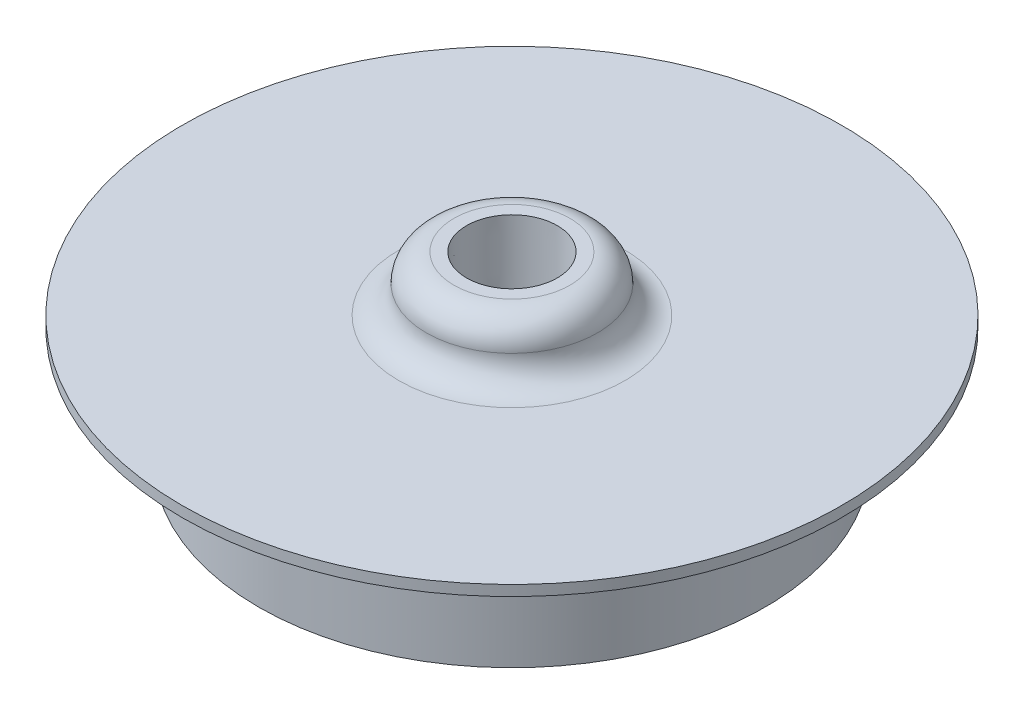
ISO-10303-21;
HEADER;
FILE_DESCRIPTION(('STEP AP214'),'2;1');
FILE_NAME('part.step','',(''),(''),'','','');
FILE_SCHEMA(('AUTOMOTIVE_DESIGN { 1 0 10303 214 1 1 1 1 }'));
ENDSEC;
DATA;
#1=APPLICATION_CONTEXT('core data for automotive mechanical design processes');
#2=APPLICATION_PROTOCOL_DEFINITION('international standard','automotive_design',2000,#1);
#3=PRODUCT_CONTEXT('',#1,'mechanical');
#4=PRODUCT('Part','Part','',(#3));
#5=PRODUCT_RELATED_PRODUCT_CATEGORY('part','',(#4));
#6=PRODUCT_DEFINITION_FORMATION('','',#4);
#7=PRODUCT_DEFINITION_CONTEXT('part definition',#1,'design');
#8=PRODUCT_DEFINITION('design','',#6,#7);
#9=PRODUCT_DEFINITION_SHAPE('','',#8);
#10=(LENGTH_UNIT() NAMED_UNIT(*) SI_UNIT(.MILLI.,.METRE.));
#11=(NAMED_UNIT(*) PLANE_ANGLE_UNIT() SI_UNIT($,.RADIAN.));
#12=(NAMED_UNIT(*) SI_UNIT($,.STERADIAN.) SOLID_ANGLE_UNIT());
#13=UNCERTAINTY_MEASURE_WITH_UNIT(LENGTH_MEASURE(1.E-05),#10,'distance_accuracy_value','');
#14=(GEOMETRIC_REPRESENTATION_CONTEXT(3) GLOBAL_UNCERTAINTY_ASSIGNED_CONTEXT((#13)) GLOBAL_UNIT_ASSIGNED_CONTEXT((#10,
#11,#12)) REPRESENTATION_CONTEXT('',''));
#15=CARTESIAN_POINT('',(0.,0.,0.));
#16=DIRECTION('',(0.,0.,1.));
#17=DIRECTION('',(1.,0.,0.));
#18=AXIS2_PLACEMENT_3D('',#15,#16,#17);
#19=CARTESIAN_POINT('',(0.,55.,0.));
#20=DIRECTION('',(0.,1.,0.));
#21=DIRECTION('',(0.,0.,1.));
#22=AXIS2_PLACEMENT_3D('',#19,#20,#21);
#23=CYLINDRICAL_SURFACE('',#22,49.784);
#24=CARTESIAN_POINT('',(0.,0.,0.));
#25=DIRECTION('',(0.,1.,0.));
#26=DIRECTION('',(0.,0.,1.));
#27=AXIS2_PLACEMENT_3D('',#24,#25,#26);
#28=CIRCLE('',#27,49.784);
#29=CARTESIAN_POINT('',(0.,0.,49.784));
#30=VERTEX_POINT('',#29);
#31=EDGE_CURVE('E10',#30,#30,#28,.T.);
#32=ORIENTED_EDGE('',*,*,#31,.T.);
#33=EDGE_LOOP('',(#32));
#34=FACE_BOUND('',#33,.T.);
#35=CARTESIAN_POINT('',(0.,1.5875,0.));
#36=DIRECTION('',(0.,1.,0.));
#37=DIRECTION('',(0.,0.,1.));
#38=AXIS2_PLACEMENT_3D('',#35,#36,#37);
#39=CIRCLE('',#38,49.784);
#40=CARTESIAN_POINT('',(0.,1.5875,49.784));
#41=VERTEX_POINT('',#40);
#42=EDGE_CURVE('E68',#41,#41,#39,.T.);
#43=ORIENTED_EDGE('',*,*,#42,.F.);
#44=EDGE_LOOP('',(#43));
#45=FACE_BOUND('',#44,.T.);
#46=ADVANCED_FACE('F31',(#34,#45),#23,.T.);
#47=CARTESIAN_POINT('',(-49.784,0.,0.));
#48=DIRECTION('',(0.,-1.,0.));
#49=DIRECTION('',(0.,0.,-1.));
#50=AXIS2_PLACEMENT_3D('',#47,#48,#49);
#51=PLANE('',#50);
#52=CARTESIAN_POINT('',(0.,0.,0.));
#53=DIRECTION('',(0.,1.,0.));
#54=DIRECTION('',(0.,0.,1.));
#55=AXIS2_PLACEMENT_3D('',#52,#53,#54);
#56=CIRCLE('',#55,39.8398999993228);
#57=CARTESIAN_POINT('',(0.,0.,39.8398999993228));
#58=VERTEX_POINT('',#57);
#59=EDGE_CURVE('E37',#58,#58,#56,.T.);
#60=ORIENTED_EDGE('',*,*,#59,.T.);
#61=EDGE_LOOP('',(#60));
#62=FACE_BOUND('',#61,.T.);
#63=ORIENTED_EDGE('',*,*,#31,.F.);
#64=EDGE_LOOP('',(#63));
#65=FACE_BOUND('',#64,.T.);
#66=ADVANCED_FACE('F99',(#62,#65),#51,.T.);
#67=CARTESIAN_POINT('',(0.,-1.5875,0.));
#68=DIRECTION('',(0.,1.,0.));
#69=DIRECTION('',(0.,0.,1.));
#70=AXIS2_PLACEMENT_3D('',#67,#68,#69);
#71=TOROIDAL_SURFACE('',#70,39.8398999993228,1.5875);
#72=CARTESIAN_POINT('',(0.,-1.5875,0.));
#73=DIRECTION('',(0.,1.,0.));
#74=DIRECTION('',(0.,0.,1.));
#75=AXIS2_PLACEMENT_3D('',#72,#73,#74);
#76=CIRCLE('',#75,38.2523999993228);
#77=CARTESIAN_POINT('',(0.,-1.5875,38.2523999993228));
#78=VERTEX_POINT('',#77);
#79=EDGE_CURVE('E41',#78,#78,#76,.T.);
#80=ORIENTED_EDGE('',*,*,#79,.T.);
#81=EDGE_LOOP('',(#80));
#82=FACE_BOUND('',#81,.T.);
#83=ORIENTED_EDGE('',*,*,#59,.F.);
#84=EDGE_LOOP('',(#83));
#85=FACE_BOUND('',#84,.T.);
#86=ADVANCED_FACE('F103',(#82,#85),#71,.F.);
#87=CARTESIAN_POINT('',(0.,55.,0.));
#88=DIRECTION('',(0.,1.,0.));
#89=DIRECTION('',(0.,0.,1.));
#90=AXIS2_PLACEMENT_3D('',#87,#88,#89);
#91=CYLINDRICAL_SURFACE('',#90,38.2523999996614);
#92=CARTESIAN_POINT('',(0.,-17.4625,0.));
#93=DIRECTION('',(0.,1.,0.));
#94=DIRECTION('',(0.,0.,1.));
#95=AXIS2_PLACEMENT_3D('',#92,#93,#94);
#96=CIRCLE('',#95,38.2524);
#97=CARTESIAN_POINT('',(0.,-17.4625,38.2524));
#98=VERTEX_POINT('',#97);
#99=EDGE_CURVE('E45',#98,#98,#96,.T.);
#100=ORIENTED_EDGE('',*,*,#99,.T.);
#101=EDGE_LOOP('',(#100));
#102=FACE_BOUND('',#101,.T.);
#103=ORIENTED_EDGE('',*,*,#79,.F.);
#104=EDGE_LOOP('',(#103));
#105=FACE_BOUND('',#104,.T.);
#106=ADVANCED_FACE('F142',(#102,#105),#91,.T.);
#107=CARTESIAN_POINT('',(-38.2524,-17.4625,0.));
#108=DIRECTION('',(0.,-1.,0.));
#109=DIRECTION('',(0.,0.,-1.));
#110=AXIS2_PLACEMENT_3D('',#107,#108,#109);
#111=PLANE('',#110);
#112=CARTESIAN_POINT('',(0.,-17.4625,0.));
#113=DIRECTION('',(0.,1.,0.));
#114=DIRECTION('',(0.,0.,1.));
#115=AXIS2_PLACEMENT_3D('',#112,#113,#114);
#116=CIRCLE('',#115,35.0774);
#117=CARTESIAN_POINT('',(0.,-17.4625,35.0774));
#118=VERTEX_POINT('',#117);
#119=EDGE_CURVE('E50',#118,#118,#116,.T.);
#120=ORIENTED_EDGE('',*,*,#119,.T.);
#121=EDGE_LOOP('',(#120));
#122=FACE_BOUND('',#121,.T.);
#123=ORIENTED_EDGE('',*,*,#99,.F.);
#124=EDGE_LOOP('',(#123));
#125=FACE_BOUND('',#124,.T.);
#126=ADVANCED_FACE('F136',(#122,#125),#111,.T.);
#127=CARTESIAN_POINT('',(0.,55.,0.));
#128=DIRECTION('',(0.,1.,0.));
#129=DIRECTION('',(0.,0.,1.));
#130=AXIS2_PLACEMENT_3D('',#127,#128,#129);
#131=CYLINDRICAL_SURFACE('',#130,35.0774);
#132=CARTESIAN_POINT('',(0.,-3.175,0.));
#133=DIRECTION('',(0.,1.,0.));
#134=DIRECTION('',(0.,0.,1.));
#135=AXIS2_PLACEMENT_3D('',#132,#133,#134);
#136=CIRCLE('',#135,35.0774);
#137=CARTESIAN_POINT('',(0.,-3.175,35.0774));
#138=VERTEX_POINT('',#137);
#139=EDGE_CURVE('E53',#138,#138,#136,.T.);
#140=ORIENTED_EDGE('',*,*,#139,.T.);
#141=EDGE_LOOP('',(#140));
#142=FACE_BOUND('',#141,.T.);
#143=ORIENTED_EDGE('',*,*,#119,.F.);
#144=EDGE_LOOP('',(#143));
#145=FACE_BOUND('',#144,.T.);
#146=ADVANCED_FACE('F130',(#142,#145),#131,.F.);
#147=CARTESIAN_POINT('',(0.,-3.175,0.));
#148=DIRECTION('',(0.,1.,0.));
#149=DIRECTION('',(0.,0.,1.));
#150=AXIS2_PLACEMENT_3D('',#147,#148,#149);
#151=TOROIDAL_SURFACE('',#150,31.9024,3.175);
#152=CARTESIAN_POINT('',(0.,0.,0.));
#153=DIRECTION('',(0.,1.,0.));
#154=DIRECTION('',(0.,0.,1.));
#155=AXIS2_PLACEMENT_3D('',#152,#153,#154);
#156=CIRCLE('',#155,31.9024);
#157=CARTESIAN_POINT('',(0.,0.,31.9024));
#158=VERTEX_POINT('',#157);
#159=EDGE_CURVE('E56',#158,#158,#156,.T.);
#160=ORIENTED_EDGE('',*,*,#159,.T.);
#161=EDGE_LOOP('',(#160));
#162=FACE_BOUND('',#161,.T.);
#163=ORIENTED_EDGE('',*,*,#139,.F.);
#164=EDGE_LOOP('',(#163));
#165=FACE_BOUND('',#164,.T.);
#166=ADVANCED_FACE('F124',(#162,#165),#151,.F.);
#167=CARTESIAN_POINT('',(-31.9024,0.,0.));
#168=DIRECTION('',(0.,-1.,0.));
#169=DIRECTION('',(0.,0.,-1.));
#170=AXIS2_PLACEMENT_3D('',#167,#168,#169);
#171=PLANE('',#170);
#172=CARTESIAN_POINT('',(0.,0.,0.));
#173=DIRECTION('',(0.,1.,0.));
#174=DIRECTION('',(0.,0.,1.));
#175=AXIS2_PLACEMENT_3D('',#172,#173,#174);
#176=CIRCLE('',#175,6.55798479417671);
#177=CARTESIAN_POINT('',(0.,0.,6.55798479417671));
#178=VERTEX_POINT('',#177);
#179=EDGE_CURVE('E71',#178,#178,#176,.T.);
#180=ORIENTED_EDGE('',*,*,#179,.T.);
#181=EDGE_LOOP('',(#180));
#182=FACE_BOUND('',#181,.T.);
#183=ORIENTED_EDGE('',*,*,#159,.F.);
#184=EDGE_LOOP('',(#183));
#185=FACE_BOUND('',#184,.T.);
#186=ADVANCED_FACE('F84',(#182,#185),#171,.T.);
#187=CARTESIAN_POINT('',(-5.588,9.906,0.));
#188=DIRECTION('',(0.,1.,0.));
#189=DIRECTION('',(0.,0.,1.));
#190=AXIS2_PLACEMENT_3D('',#187,#188,#189);
#191=PLANE('',#190);
#192=CARTESIAN_POINT('',(0.,9.906,0.));
#193=DIRECTION('',(0.,1.,0.));
#194=DIRECTION('',(0.,0.,1.));
#195=AXIS2_PLACEMENT_3D('',#192,#193,#194);
#196=CIRCLE('',#195,6.8545837);
#197=CARTESIAN_POINT('',(0.,9.906,6.8545837));
#198=VERTEX_POINT('',#197);
#199=EDGE_CURVE('E74',#198,#198,#196,.T.);
#200=ORIENTED_EDGE('',*,*,#199,.F.);
#201=EDGE_LOOP('',(#200));
#202=FACE_BOUND('',#201,.T.);
#203=CARTESIAN_POINT('',(0.,9.906,0.));
#204=DIRECTION('',(0.,1.,0.));
#205=DIRECTION('',(0.,0.,1.));
#206=AXIS2_PLACEMENT_3D('',#203,#204,#205);
#207=CIRCLE('',#206,8.763);
#208=CARTESIAN_POINT('',(0.,9.906,8.763));
#209=VERTEX_POINT('',#208);
#210=EDGE_CURVE('E59',#209,#209,#207,.T.);
#211=ORIENTED_EDGE('',*,*,#210,.T.);
#212=EDGE_LOOP('',(#211));
#213=FACE_BOUND('',#212,.T.);
#214=ADVANCED_FACE('F80',(#202,#213),#191,.T.);
#215=CARTESIAN_POINT('',(0.,5.74675,0.));
#216=DIRECTION('',(0.,1.,0.));
#217=DIRECTION('',(0.,0.,1.));
#218=AXIS2_PLACEMENT_3D('',#215,#216,#217);
#219=TOROIDAL_SURFACE('',#218,8.763,4.15925);
#220=CARTESIAN_POINT('',(0.,5.74675,0.));
#221=DIRECTION('',(0.,1.,0.));
#222=DIRECTION('',(0.,0.,1.));
#223=AXIS2_PLACEMENT_3D('',#220,#221,#222);
#224=CIRCLE('',#223,12.92225);
#225=CARTESIAN_POINT('',(0.,5.74675,12.92225));
#226=VERTEX_POINT('',#225);
#227=EDGE_CURVE('E62',#226,#226,#224,.T.);
#228=ORIENTED_EDGE('',*,*,#227,.T.);
#229=EDGE_LOOP('',(#228));
#230=FACE_BOUND('',#229,.T.);
#231=ORIENTED_EDGE('',*,*,#210,.F.);
#232=EDGE_LOOP('',(#231));
#233=FACE_BOUND('',#232,.T.);
#234=ADVANCED_FACE('F83',(#230,#233),#219,.T.);
#235=CARTESIAN_POINT('',(0.,5.74675,0.));
#236=DIRECTION('',(0.,1.,0.));
#237=DIRECTION('',(0.,0.,1.));
#238=AXIS2_PLACEMENT_3D('',#235,#236,#237);
#239=TOROIDAL_SURFACE('',#238,17.0815,4.15925);
#240=CARTESIAN_POINT('',(0.,1.5875,0.));
#241=DIRECTION('',(0.,1.,0.));
#242=DIRECTION('',(0.,0.,1.));
#243=AXIS2_PLACEMENT_3D('',#240,#241,#242);
#244=CIRCLE('',#243,17.0815);
#245=CARTESIAN_POINT('',(0.,1.5875,17.0815));
#246=VERTEX_POINT('',#245);
#247=EDGE_CURVE('E65',#246,#246,#244,.T.);
#248=ORIENTED_EDGE('',*,*,#247,.T.);
#249=EDGE_LOOP('',(#248));
#250=FACE_BOUND('',#249,.T.);
#251=ORIENTED_EDGE('',*,*,#227,.F.);
#252=EDGE_LOOP('',(#251));
#253=FACE_BOUND('',#252,.T.);
#254=ADVANCED_FACE('F89',(#250,#253),#239,.F.);
#255=CARTESIAN_POINT('',(-49.784,1.5875,0.));
#256=DIRECTION('',(0.,1.,0.));
#257=DIRECTION('',(0.,0.,1.));
#258=AXIS2_PLACEMENT_3D('',#255,#256,#257);
#259=PLANE('',#258);
#260=ORIENTED_EDGE('',*,*,#42,.T.);
#261=EDGE_LOOP('',(#260));
#262=FACE_BOUND('',#261,.T.);
#263=ORIENTED_EDGE('',*,*,#247,.F.);
#264=EDGE_LOOP('',(#263));
#265=FACE_BOUND('',#264,.T.);
#266=ADVANCED_FACE('F95',(#262,#265),#259,.T.);
#267=CARTESIAN_POINT('',(0.,9.906,0.));
#268=DIRECTION('',(0.,1.,0.));
#269=DIRECTION('',(0.,0.,1.));
#270=AXIS2_PLACEMENT_3D('',#267,#268,#269);
#271=CONICAL_SURFACE('',#270,6.8545837,0.029932396671703);
#272=ORIENTED_EDGE('',*,*,#179,.F.);
#273=EDGE_LOOP('',(#272));
#274=FACE_BOUND('',#273,.T.);
#275=ORIENTED_EDGE('',*,*,#199,.T.);
#276=EDGE_LOOP('',(#275));
#277=FACE_BOUND('',#276,.T.);
#278=ADVANCED_FACE('F78',(#274,#277),#271,.F.);
#279=CLOSED_SHELL('',(#46,#66,#86,#106,#126,#146,#166,#186,#214,#234,#254,#266,#278));
#280=MANIFOLD_SOLID_BREP('B2',#279);
#281=ADVANCED_BREP_SHAPE_REPRESENTATION('',(#18,#280),#14);
#282=SHAPE_DEFINITION_REPRESENTATION(#9,#281);
ENDSEC;
END-ISO-10303-21;
